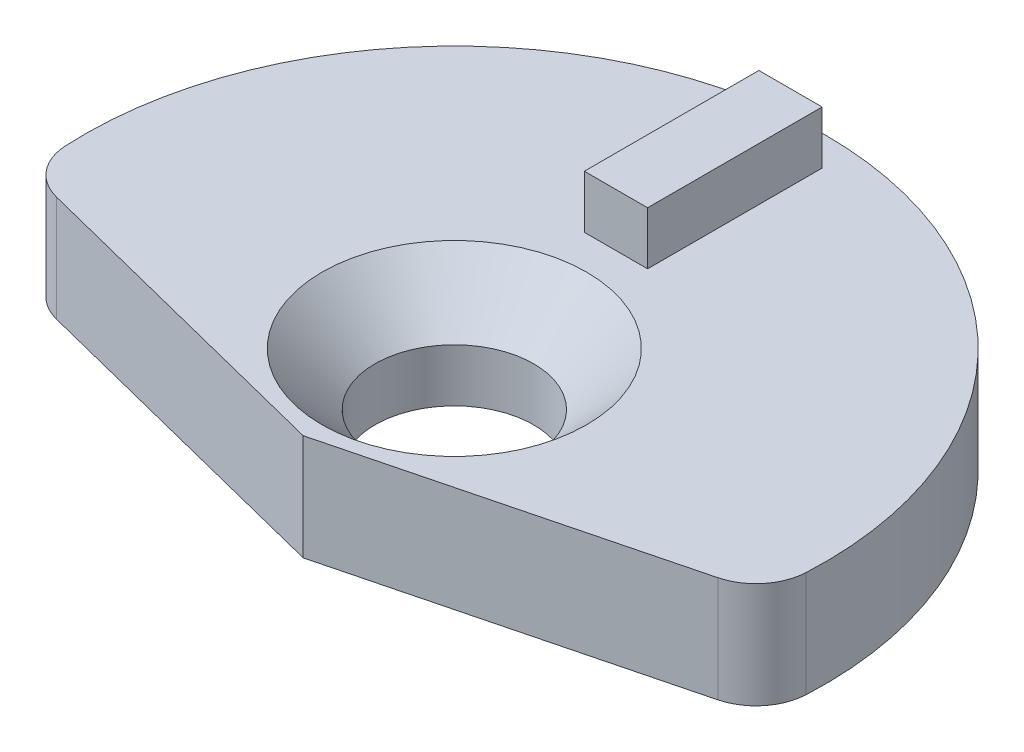
ISO-10303-21;
HEADER;
FILE_DESCRIPTION(('STEP AP214'),'2;1');
FILE_NAME('part.step','',(''),(''),'','','');
FILE_SCHEMA(('AUTOMOTIVE_DESIGN { 1 0 10303 214 1 1 1 1 }'));
ENDSEC;
DATA;
#1=APPLICATION_CONTEXT('core data for automotive mechanical design processes');
#2=APPLICATION_PROTOCOL_DEFINITION('international standard','automotive_design',2000,#1);
#3=PRODUCT_CONTEXT('',#1,'mechanical');
#4=PRODUCT('Part','Part','',(#3));
#5=PRODUCT_RELATED_PRODUCT_CATEGORY('part','',(#4));
#6=PRODUCT_DEFINITION_FORMATION('','',#4);
#7=PRODUCT_DEFINITION_CONTEXT('part definition',#1,'design');
#8=PRODUCT_DEFINITION('design','',#6,#7);
#9=PRODUCT_DEFINITION_SHAPE('','',#8);
#10=(LENGTH_UNIT() NAMED_UNIT(*) SI_UNIT(.MILLI.,.METRE.));
#11=(NAMED_UNIT(*) PLANE_ANGLE_UNIT() SI_UNIT($,.RADIAN.));
#12=(NAMED_UNIT(*) SI_UNIT($,.STERADIAN.) SOLID_ANGLE_UNIT());
#13=UNCERTAINTY_MEASURE_WITH_UNIT(LENGTH_MEASURE(1.E-05),#10,'distance_accuracy_value','');
#14=(GEOMETRIC_REPRESENTATION_CONTEXT(3) GLOBAL_UNCERTAINTY_ASSIGNED_CONTEXT((#13)) GLOBAL_UNIT_ASSIGNED_CONTEXT((#10,
#11,#12)) REPRESENTATION_CONTEXT('',''));
#15=CARTESIAN_POINT('',(0.,0.,0.));
#16=DIRECTION('',(0.,0.,1.));
#17=DIRECTION('',(1.,0.,0.));
#18=AXIS2_PLACEMENT_3D('',#15,#16,#17);
#19=CARTESIAN_POINT('',(-0.805155445888059,2.,2.10326320558514));
#20=DIRECTION('',(0.,1.,0.));
#21=DIRECTION('',(0.,0.,1.));
#22=AXIS2_PLACEMENT_3D('',#19,#20,#21);
#23=PLANE('',#22);
#24=DIRECTION('',(-0.968898579478577,0.,0.247458163503238));
#25=VECTOR('',#24,1.);
#26=CARTESIAN_POINT('',(7.40407739532381,2.,2.86219767816874));
#27=LINE('',#26,#25);
#28=CARTESIAN_POINT('',(5.43514909799933,2.,3.36506494502724));
#29=VERTEX_POINT('',#28);
#30=CARTESIAN_POINT('',(-0.805155445888059,2.,4.958848169441));
#31=VERTEX_POINT('',#30);
#32=EDGE_CURVE('E103',#29,#31,#27,.T.);
#33=ORIENTED_EDGE('',*,*,#32,.F.);
#34=CARTESIAN_POINT('',(5.18769093449609,2.,2.39616636554866));
#35=DIRECTION('',(0.,1.,0.));
#36=DIRECTION('',(0.,0.,1.));
#37=AXIS2_PLACEMENT_3D('',#34,#35,#36);
#38=CIRCLE('',#37,1.);
#39=CARTESIAN_POINT('',(6.18649866456011,2.,2.44498355887591));
#40=VERTEX_POINT('',#39);
#41=EDGE_CURVE('E41',#29,#40,#38,.T.);
#42=ORIENTED_EDGE('',*,*,#41,.T.);
#43=CARTESIAN_POINT('',(-0.805155445888059,2.,2.10326320558514));
#44=DIRECTION('',(0.,1.,0.));
#45=DIRECTION('',(0.,0.,1.));
#46=AXIS2_PLACEMENT_3D('',#43,#44,#45);
#47=CIRCLE('',#46,7.);
#48=CARTESIAN_POINT('',(-7.79569640651372,2.,2.46704484038116));
#49=VERTEX_POINT('',#48);
#50=EDGE_CURVE('E156',#40,#49,#47,.T.);
#51=ORIENTED_EDGE('',*,*,#50,.T.);
#52=CARTESIAN_POINT('',(-6.79704769785291,2.,2.4150760354103));
#53=DIRECTION('',(0.,1.,0.));
#54=DIRECTION('',(0.,0.,1.));
#55=AXIS2_PLACEMENT_3D('',#52,#53,#54);
#56=CIRCLE('',#55,1.);
#57=CARTESIAN_POINT('',(-7.04178123394202,2.,3.38466641093664));
#58=VERTEX_POINT('',#57);
#59=EDGE_CURVE('E48',#49,#58,#56,.T.);
#60=ORIENTED_EDGE('',*,*,#59,.T.);
#61=DIRECTION('',(-0.969590375526346,0.,-0.244733536089108));
#62=VECTOR('',#61,1.);
#63=CARTESIAN_POINT('',(-0.805155445888059,2.,4.958848169441));
#64=LINE('',#63,#62);
#65=EDGE_CURVE('E108',#31,#58,#64,.T.);
#66=ORIENTED_EDGE('',*,*,#65,.F.);
#67=EDGE_LOOP('',(#33,#42,#51,#60,#66));
#68=FACE_BOUND('',#67,.T.);
#69=CARTESIAN_POINT('',(-0.805155445888059,2.,2.10326320558514));
#70=DIRECTION('',(0.,1.,0.));
#71=DIRECTION('',(0.,0.,1.));
#72=AXIS2_PLACEMENT_3D('',#69,#70,#71);
#73=CIRCLE('',#72,2.50000000000001);
#74=CARTESIAN_POINT('',(-0.805155445888059,2.,4.60326320558514));
#75=VERTEX_POINT('',#74);
#76=EDGE_CURVE('E163',#75,#75,#73,.F.);
#77=ORIENTED_EDGE('',*,*,#76,.T.);
#78=EDGE_LOOP('',(#77));
#79=FACE_BOUND('',#78,.T.);
#80=DIRECTION('',(1.,0.,0.));
#81=VECTOR('',#80,1.);
#82=CARTESIAN_POINT('',(-1.47747534327316,2.,-1.02626791179342));
#83=LINE('',#82,#81);
#84=CARTESIAN_POINT('',(-1.47747534327316,2.,-1.02626791179342));
#85=VERTEX_POINT('',#84);
#86=CARTESIAN_POINT('',(-0.282239970144092,2.,-1.02626791179342));
#87=VERTEX_POINT('',#86);
#88=EDGE_CURVE('E137',#85,#87,#83,.T.);
#89=ORIENTED_EDGE('',*,*,#88,.F.);
#90=DIRECTION('',(0.,0.,1.));
#91=VECTOR('',#90,1.);
#92=CARTESIAN_POINT('',(-1.47747534327316,2.,-4.32465783571691));
#93=LINE('',#92,#91);
#94=CARTESIAN_POINT('',(-1.47747534327316,2.,-4.32465783571691));
#95=VERTEX_POINT('',#94);
#96=EDGE_CURVE('E123',#95,#85,#93,.T.);
#97=ORIENTED_EDGE('',*,*,#96,.F.);
#98=DIRECTION('',(-1.,0.,0.));
#99=VECTOR('',#98,1.);
#100=CARTESIAN_POINT('',(-1.47747534327316,2.,-4.32465783571691));
#101=LINE('',#100,#99);
#102=CARTESIAN_POINT('',(-0.282239970144092,2.,-4.32465783571691));
#103=VERTEX_POINT('',#102);
#104=EDGE_CURVE('E128',#103,#95,#101,.T.);
#105=ORIENTED_EDGE('',*,*,#104,.F.);
#106=DIRECTION('',(0.,0.,-1.));
#107=VECTOR('',#106,1.);
#108=CARTESIAN_POINT('',(-0.282239970144092,2.,-4.32465783571691));
#109=LINE('',#108,#107);
#110=EDGE_CURVE('E139',#87,#103,#109,.T.);
#111=ORIENTED_EDGE('',*,*,#110,.F.);
#112=EDGE_LOOP('',(#89,#97,#105,#111));
#113=FACE_BOUND('',#112,.T.);
#114=ADVANCED_FACE('F33',(#68,#79,#113),#23,.T.);
#115=CARTESIAN_POINT('',(-0.805155445888059,0.,2.10326320558514));
#116=DIRECTION('',(0.,1.,0.));
#117=DIRECTION('',(0.,0.,1.));
#118=AXIS2_PLACEMENT_3D('',#115,#116,#117);
#119=PLANE('',#118);
#120=CARTESIAN_POINT('',(-0.805155445888059,0.,2.10326320558514));
#121=DIRECTION('',(0.,1.,0.));
#122=DIRECTION('',(0.,0.,1.));
#123=AXIS2_PLACEMENT_3D('',#120,#121,#122);
#124=CIRCLE('',#123,7.);
#125=CARTESIAN_POINT('',(6.18649866456011,0.,2.44498355887591));
#126=VERTEX_POINT('',#125);
#127=CARTESIAN_POINT('',(-7.79569640651372,0.,2.46704484038116));
#128=VERTEX_POINT('',#127);
#129=EDGE_CURVE('E155',#126,#128,#124,.T.);
#130=ORIENTED_EDGE('',*,*,#129,.F.);
#131=CARTESIAN_POINT('',(5.18769093449609,0.,2.39616636554866));
#132=DIRECTION('',(0.,1.,0.));
#133=DIRECTION('',(0.,0.,1.));
#134=AXIS2_PLACEMENT_3D('',#131,#132,#133);
#135=CIRCLE('',#134,1.);
#136=CARTESIAN_POINT('',(5.43514909799933,0.,3.36506494502724));
#137=VERTEX_POINT('',#136);
#138=EDGE_CURVE('E174',#126,#137,#135,.F.);
#139=ORIENTED_EDGE('',*,*,#138,.T.);
#140=DIRECTION('',(-0.968898579478577,0.,0.247458163503238));
#141=VECTOR('',#140,1.);
#142=CARTESIAN_POINT('',(-0.120495074717444,0.,4.78398487449789));
#143=LINE('',#142,#141);
#144=CARTESIAN_POINT('',(-0.805155445888059,0.,4.958848169441));
#145=VERTEX_POINT('',#144);
#146=EDGE_CURVE('E121',#137,#145,#143,.T.);
#147=ORIENTED_EDGE('',*,*,#146,.T.);
#148=DIRECTION('',(-0.969590375526346,0.,-0.244733536089108));
#149=VECTOR('',#148,1.);
#150=CARTESIAN_POINT('',(-1.48276086042416,0.,4.78781432529571));
#151=LINE('',#150,#149);
#152=CARTESIAN_POINT('',(-7.04178123394202,0.,3.38466641093664));
#153=VERTEX_POINT('',#152);
#154=EDGE_CURVE('E115',#145,#153,#151,.T.);
#155=ORIENTED_EDGE('',*,*,#154,.T.);
#156=CARTESIAN_POINT('',(-6.79704769785291,0.,2.4150760354103));
#157=DIRECTION('',(0.,1.,0.));
#158=DIRECTION('',(0.,0.,1.));
#159=AXIS2_PLACEMENT_3D('',#156,#157,#158);
#160=CIRCLE('',#159,1.);
#161=EDGE_CURVE('E172',#153,#128,#160,.F.);
#162=ORIENTED_EDGE('',*,*,#161,.T.);
#163=EDGE_LOOP('',(#130,#139,#147,#155,#162));
#164=FACE_BOUND('',#163,.T.);
#165=CARTESIAN_POINT('',(-0.805155445888059,0.,2.10326320558514));
#166=DIRECTION('',(0.,1.,0.));
#167=DIRECTION('',(0.,0.,1.));
#168=AXIS2_PLACEMENT_3D('',#165,#166,#167);
#169=CIRCLE('',#168,1.5);
#170=CARTESIAN_POINT('',(-0.805155445888059,0.,3.60326320558514));
#171=VERTEX_POINT('',#170);
#172=EDGE_CURVE('E152',#171,#171,#169,.T.);
#173=ORIENTED_EDGE('',*,*,#172,.T.);
#174=EDGE_LOOP('',(#173));
#175=FACE_BOUND('',#174,.T.);
#176=ADVANCED_FACE('F186',(#164,#175),#119,.F.);
#177=CARTESIAN_POINT('',(-0.805155445888059,2.,2.10326320558514));
#178=DIRECTION('',(0.,-1.,0.));
#179=DIRECTION('',(0.,0.,-1.));
#180=AXIS2_PLACEMENT_3D('',#177,#178,#179);
#181=CYLINDRICAL_SURFACE('',#180,7.);
#182=ORIENTED_EDGE('',*,*,#50,.F.);
#183=DIRECTION('',(0.,-1.,0.));
#184=VECTOR('',#183,1.);
#185=CARTESIAN_POINT('',(6.18649866456012,2.,2.44498355887591));
#186=LINE('',#185,#184);
#187=EDGE_CURVE('E169',#40,#126,#186,.T.);
#188=ORIENTED_EDGE('',*,*,#187,.T.);
#189=ORIENTED_EDGE('',*,*,#129,.T.);
#190=DIRECTION('',(0.,-1.,0.));
#191=VECTOR('',#190,1.);
#192=CARTESIAN_POINT('',(-7.79569640651372,2.,2.46704484038116));
#193=LINE('',#192,#191);
#194=EDGE_CURVE('E166',#128,#49,#193,.F.);
#195=ORIENTED_EDGE('',*,*,#194,.T.);
#196=EDGE_LOOP('',(#182,#188,#189,#195));
#197=FACE_BOUND('',#196,.T.);
#198=ADVANCED_FACE('F181',(#197),#181,.T.);
#199=CARTESIAN_POINT('',(-0.805155445888059,2.,2.10326320558514));
#200=DIRECTION('',(0.,-1.,0.));
#201=DIRECTION('',(0.,0.,-1.));
#202=AXIS2_PLACEMENT_3D('',#199,#200,#201);
#203=CYLINDRICAL_SURFACE('',#202,1.5);
#204=CARTESIAN_POINT('',(-0.805155445888059,0.999999999999996,2.10326320558514));
#205=DIRECTION('',(0.,1.,0.));
#206=DIRECTION('',(0.,0.,1.));
#207=AXIS2_PLACEMENT_3D('',#204,#205,#206);
#208=CIRCLE('',#207,1.5);
#209=CARTESIAN_POINT('',(-0.805155445888059,0.999999999999996,3.60326320558514));
#210=VERTEX_POINT('',#209);
#211=EDGE_CURVE('E158',#210,#210,#208,.T.);
#212=ORIENTED_EDGE('',*,*,#211,.T.);
#213=EDGE_LOOP('',(#212));
#214=FACE_BOUND('',#213,.T.);
#215=ORIENTED_EDGE('',*,*,#172,.F.);
#216=EDGE_LOOP('',(#215));
#217=FACE_BOUND('',#216,.T.);
#218=ADVANCED_FACE('F201',(#214,#217),#203,.F.);
#219=CARTESIAN_POINT('',(-0.805155445888059,0.999999999999996,2.10326320558514));
#220=DIRECTION('',(0.,1.,0.));
#221=DIRECTION('',(0.,0.,1.));
#222=AXIS2_PLACEMENT_3D('',#219,#220,#221);
#223=CONICAL_SURFACE('',#222,1.5,0.78539816339745);
#224=ORIENTED_EDGE('',*,*,#76,.F.);
#225=EDGE_LOOP('',(#224));
#226=FACE_BOUND('',#225,.T.);
#227=ORIENTED_EDGE('',*,*,#211,.F.);
#228=EDGE_LOOP('',(#227));
#229=FACE_BOUND('',#228,.T.);
#230=ADVANCED_FACE('F206',(#226,#229),#223,.F.);
#231=CARTESIAN_POINT('',(-1.47747534327316,3.,-4.32465783571691));
#232=DIRECTION('',(1.,0.,0.));
#233=DIRECTION('',(0.,0.,-1.));
#234=AXIS2_PLACEMENT_3D('',#231,#232,#233);
#235=PLANE('',#234);
#236=ORIENTED_EDGE('',*,*,#96,.T.);
#237=DIRECTION('',(0.,-1.,0.));
#238=VECTOR('',#237,1.);
#239=CARTESIAN_POINT('',(-1.47747534327316,3.,-1.02626791179342));
#240=LINE('',#239,#238);
#241=CARTESIAN_POINT('',(-1.47747534327316,3.,-1.02626791179342));
#242=VERTEX_POINT('',#241);
#243=EDGE_CURVE('E150',#242,#85,#240,.T.);
#244=ORIENTED_EDGE('',*,*,#243,.F.);
#245=DIRECTION('',(0.,0.,1.));
#246=VECTOR('',#245,1.);
#247=CARTESIAN_POINT('',(-1.47747534327316,3.,-4.32465783571691));
#248=LINE('',#247,#246);
#249=CARTESIAN_POINT('',(-1.47747534327316,3.,-4.32465783571691));
#250=VERTEX_POINT('',#249);
#251=EDGE_CURVE('E124',#250,#242,#248,.T.);
#252=ORIENTED_EDGE('',*,*,#251,.F.);
#253=DIRECTION('',(0.,-1.,0.));
#254=VECTOR('',#253,1.);
#255=CARTESIAN_POINT('',(-1.47747534327316,3.,-4.32465783571691));
#256=LINE('',#255,#254);
#257=EDGE_CURVE('E134',#250,#95,#256,.T.);
#258=ORIENTED_EDGE('',*,*,#257,.T.);
#259=EDGE_LOOP('',(#236,#244,#252,#258));
#260=FACE_BOUND('',#259,.T.);
#261=ADVANCED_FACE('F208',(#260),#235,.F.);
#262=CARTESIAN_POINT('',(-1.47747534327316,3.,-1.02626791179342));
#263=DIRECTION('',(0.,0.,-1.));
#264=DIRECTION('',(-1.,0.,0.));
#265=AXIS2_PLACEMENT_3D('',#262,#263,#264);
#266=PLANE('',#265);
#267=ORIENTED_EDGE('',*,*,#88,.T.);
#268=DIRECTION('',(0.,-1.,0.));
#269=VECTOR('',#268,1.);
#270=CARTESIAN_POINT('',(-0.282239970144092,3.,-1.02626791179342));
#271=LINE('',#270,#269);
#272=CARTESIAN_POINT('',(-0.282239970144092,3.,-1.02626791179342));
#273=VERTEX_POINT('',#272);
#274=EDGE_CURVE('E147',#273,#87,#271,.T.);
#275=ORIENTED_EDGE('',*,*,#274,.F.);
#276=DIRECTION('',(1.,0.,0.));
#277=VECTOR('',#276,1.);
#278=CARTESIAN_POINT('',(-1.47747534327316,3.,-1.02626791179342));
#279=LINE('',#278,#277);
#280=EDGE_CURVE('E127',#242,#273,#279,.T.);
#281=ORIENTED_EDGE('',*,*,#280,.F.);
#282=ORIENTED_EDGE('',*,*,#243,.T.);
#283=EDGE_LOOP('',(#267,#275,#281,#282));
#284=FACE_BOUND('',#283,.T.);
#285=ADVANCED_FACE('F214',(#284),#266,.F.);
#286=CARTESIAN_POINT('',(-0.282239970144092,3.,-4.32465783571691));
#287=DIRECTION('',(-1.,0.,0.));
#288=DIRECTION('',(0.,0.,1.));
#289=AXIS2_PLACEMENT_3D('',#286,#287,#288);
#290=PLANE('',#289);
#291=ORIENTED_EDGE('',*,*,#110,.T.);
#292=DIRECTION('',(0.,-1.,0.));
#293=VECTOR('',#292,1.);
#294=CARTESIAN_POINT('',(-0.282239970144092,3.,-4.32465783571691));
#295=LINE('',#294,#293);
#296=CARTESIAN_POINT('',(-0.282239970144092,3.,-4.32465783571691));
#297=VERTEX_POINT('',#296);
#298=EDGE_CURVE('E145',#297,#103,#295,.T.);
#299=ORIENTED_EDGE('',*,*,#298,.F.);
#300=DIRECTION('',(0.,0.,-1.));
#301=VECTOR('',#300,1.);
#302=CARTESIAN_POINT('',(-0.282239970144092,3.,-4.32465783571691));
#303=LINE('',#302,#301);
#304=EDGE_CURVE('E130',#273,#297,#303,.T.);
#305=ORIENTED_EDGE('',*,*,#304,.F.);
#306=ORIENTED_EDGE('',*,*,#274,.T.);
#307=EDGE_LOOP('',(#291,#299,#305,#306));
#308=FACE_BOUND('',#307,.T.);
#309=ADVANCED_FACE('F232',(#308),#290,.F.);
#310=CARTESIAN_POINT('',(-1.47747534327316,3.,-4.32465783571691));
#311=DIRECTION('',(0.,0.,1.));
#312=DIRECTION('',(1.,0.,0.));
#313=AXIS2_PLACEMENT_3D('',#310,#311,#312);
#314=PLANE('',#313);
#315=ORIENTED_EDGE('',*,*,#104,.T.);
#316=ORIENTED_EDGE('',*,*,#257,.F.);
#317=DIRECTION('',(-1.,0.,0.));
#318=VECTOR('',#317,1.);
#319=CARTESIAN_POINT('',(-1.47747534327316,3.,-4.32465783571691));
#320=LINE('',#319,#318);
#321=EDGE_CURVE('E132',#297,#250,#320,.T.);
#322=ORIENTED_EDGE('',*,*,#321,.F.);
#323=ORIENTED_EDGE('',*,*,#298,.T.);
#324=EDGE_LOOP('',(#315,#316,#322,#323));
#325=FACE_BOUND('',#324,.T.);
#326=ADVANCED_FACE('F240',(#325),#314,.F.);
#327=CARTESIAN_POINT('',(0.,3.,0.));
#328=DIRECTION('',(0.,1.,0.));
#329=DIRECTION('',(0.,0.,1.));
#330=AXIS2_PLACEMENT_3D('',#327,#328,#329);
#331=PLANE('',#330);
#332=ORIENTED_EDGE('',*,*,#251,.T.);
#333=ORIENTED_EDGE('',*,*,#280,.T.);
#334=ORIENTED_EDGE('',*,*,#304,.T.);
#335=ORIENTED_EDGE('',*,*,#321,.T.);
#336=EDGE_LOOP('',(#332,#333,#334,#335));
#337=FACE_BOUND('',#336,.T.);
#338=ADVANCED_FACE('F236',(#337),#331,.T.);
#339=CARTESIAN_POINT('',(7.40407739532381,-3.,2.86219767816874));
#340=DIRECTION('',(-0.247458163503238,0.,-0.968898579478577));
#341=DIRECTION('',(-0.968898579478577,0.,0.247458163503238));
#342=AXIS2_PLACEMENT_3D('',#339,#340,#341);
#343=PLANE('',#342);
#344=ORIENTED_EDGE('',*,*,#146,.F.);
#345=DIRECTION('',(0.,-1.,0.));
#346=VECTOR('',#345,1.);
#347=CARTESIAN_POINT('',(5.43514909799933,-3.,3.36506494502724));
#348=LINE('',#347,#346);
#349=EDGE_CURVE('E56',#137,#29,#348,.F.);
#350=ORIENTED_EDGE('',*,*,#349,.T.);
#351=ORIENTED_EDGE('',*,*,#32,.T.);
#352=DIRECTION('',(0.,1.,0.));
#353=VECTOR('',#352,1.);
#354=CARTESIAN_POINT('',(-0.805155445888059,-3.,4.958848169441));
#355=LINE('',#354,#353);
#356=EDGE_CURVE('E106',#145,#31,#355,.T.);
#357=ORIENTED_EDGE('',*,*,#356,.F.);
#358=EDGE_LOOP('',(#344,#350,#351,#357));
#359=FACE_BOUND('',#358,.T.);
#360=ADVANCED_FACE('F105',(#359),#343,.F.);
#361=CARTESIAN_POINT('',(-0.805155445888059,-3.,4.958848169441));
#362=DIRECTION('',(0.244733536089108,0.,-0.969590375526346));
#363=DIRECTION('',(-0.969590375526346,0.,-0.244733536089108));
#364=AXIS2_PLACEMENT_3D('',#361,#362,#363);
#365=PLANE('',#364);
#366=ORIENTED_EDGE('',*,*,#65,.T.);
#367=DIRECTION('',(0.,-1.,0.));
#368=VECTOR('',#367,1.);
#369=CARTESIAN_POINT('',(-7.04178123394202,-3.,3.38466641093664));
#370=LINE('',#369,#368);
#371=EDGE_CURVE('E11',#58,#153,#370,.T.);
#372=ORIENTED_EDGE('',*,*,#371,.T.);
#373=ORIENTED_EDGE('',*,*,#154,.F.);
#374=ORIENTED_EDGE('',*,*,#356,.T.);
#375=EDGE_LOOP('',(#366,#372,#373,#374));
#376=FACE_BOUND('',#375,.T.);
#377=ADVANCED_FACE('F112',(#376),#365,.F.);
#378=CARTESIAN_POINT('',(5.18769093449609,2.,2.39616636554866));
#379=DIRECTION('',(0.,-1.,0.));
#380=DIRECTION('',(0.,0.,-1.));
#381=AXIS2_PLACEMENT_3D('',#378,#379,#380);
#382=CYLINDRICAL_SURFACE('',#381,1.);
#383=ORIENTED_EDGE('',*,*,#41,.F.);
#384=ORIENTED_EDGE('',*,*,#349,.F.);
#385=ORIENTED_EDGE('',*,*,#138,.F.);
#386=ORIENTED_EDGE('',*,*,#187,.F.);
#387=EDGE_LOOP('',(#383,#384,#385,#386));
#388=FACE_BOUND('',#387,.T.);
#389=ADVANCED_FACE('F184',(#388),#382,.T.);
#390=CARTESIAN_POINT('',(-6.79704769785291,2.,2.4150760354103));
#391=DIRECTION('',(0.,-1.,0.));
#392=DIRECTION('',(0.,0.,-1.));
#393=AXIS2_PLACEMENT_3D('',#390,#391,#392);
#394=CYLINDRICAL_SURFACE('',#393,1.);
#395=ORIENTED_EDGE('',*,*,#161,.F.);
#396=ORIENTED_EDGE('',*,*,#371,.F.);
#397=ORIENTED_EDGE('',*,*,#59,.F.);
#398=ORIENTED_EDGE('',*,*,#194,.F.);
#399=EDGE_LOOP('',(#395,#396,#397,#398));
#400=FACE_BOUND('',#399,.T.);
#401=ADVANCED_FACE('F35',(#400),#394,.T.);
#402=CLOSED_SHELL('',(#114,#176,#198,#218,#230,#261,#285,#309,#326,#338,#360,#377,#389,#401));
#403=MANIFOLD_SOLID_BREP('B2',#402);
#404=ADVANCED_BREP_SHAPE_REPRESENTATION('',(#18,#403),#14);
#405=SHAPE_DEFINITION_REPRESENTATION(#9,#404);
ENDSEC;
END-ISO-10303-21;
